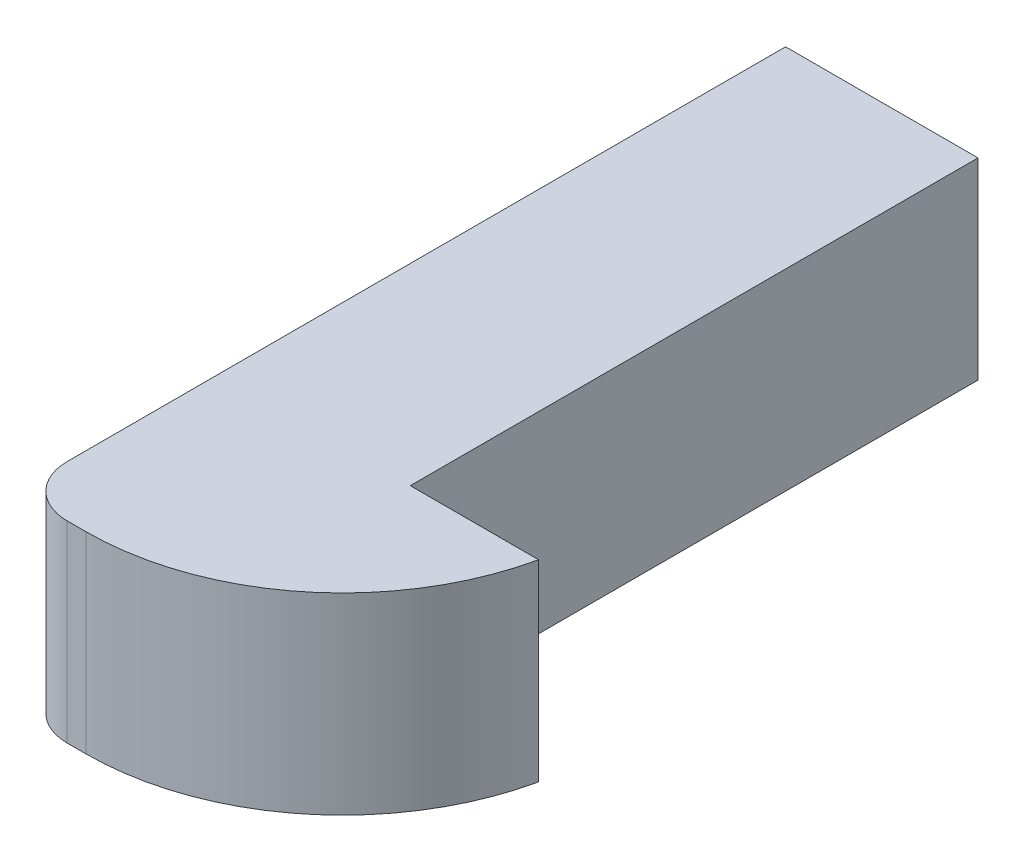
ISO-10303-21;
HEADER;
FILE_DESCRIPTION(('STEP AP214'),'2;1');
FILE_NAME('part.step','',(''),(''),'','','');
FILE_SCHEMA(('AUTOMOTIVE_DESIGN { 1 0 10303 214 1 1 1 1 }'));
ENDSEC;
DATA;
#1=APPLICATION_CONTEXT('core data for automotive mechanical design processes');
#2=APPLICATION_PROTOCOL_DEFINITION('international standard','automotive_design',2000,#1);
#3=PRODUCT_CONTEXT('',#1,'mechanical');
#4=PRODUCT('Part','Part','',(#3));
#5=PRODUCT_RELATED_PRODUCT_CATEGORY('part','',(#4));
#6=PRODUCT_DEFINITION_FORMATION('','',#4);
#7=PRODUCT_DEFINITION_CONTEXT('part definition',#1,'design');
#8=PRODUCT_DEFINITION('design','',#6,#7);
#9=PRODUCT_DEFINITION_SHAPE('','',#8);
#10=(LENGTH_UNIT() NAMED_UNIT(*) SI_UNIT(.MILLI.,.METRE.));
#11=(NAMED_UNIT(*) PLANE_ANGLE_UNIT() SI_UNIT($,.RADIAN.));
#12=(NAMED_UNIT(*) SI_UNIT($,.STERADIAN.) SOLID_ANGLE_UNIT());
#13=UNCERTAINTY_MEASURE_WITH_UNIT(LENGTH_MEASURE(1.E-05),#10,'distance_accuracy_value','');
#14=(GEOMETRIC_REPRESENTATION_CONTEXT(3) GLOBAL_UNCERTAINTY_ASSIGNED_CONTEXT((#13)) GLOBAL_UNIT_ASSIGNED_CONTEXT((#10,
#11,#12)) REPRESENTATION_CONTEXT('',''));
#15=CARTESIAN_POINT('',(0.,0.,0.));
#16=DIRECTION('',(0.,0.,1.));
#17=DIRECTION('',(1.,0.,0.));
#18=AXIS2_PLACEMENT_3D('',#15,#16,#17);
#19=CARTESIAN_POINT('',(0.,0.,38.1));
#20=DIRECTION('',(-1.,0.,0.));
#21=DIRECTION('',(0.,-1.,0.));
#22=AXIS2_PLACEMENT_3D('',#19,#20,#21);
#23=PLANE('',#22);
#24=DIRECTION('',(0.,1.,0.));
#25=VECTOR('',#24,1.);
#26=CARTESIAN_POINT('',(0.,9.525,28.1));
#27=LINE('',#26,#25);
#28=CARTESIAN_POINT('',(0.,0.,28.1));
#29=VERTEX_POINT('',#28);
#30=CARTESIAN_POINT('',(0.,9.525,28.1));
#31=VERTEX_POINT('',#30);
#32=EDGE_CURVE('E92',#29,#31,#27,.T.);
#33=ORIENTED_EDGE('',*,*,#32,.F.);
#34=DIRECTION('',(0.,0.,-1.));
#35=VECTOR('',#34,1.);
#36=CARTESIAN_POINT('',(0.,0.,38.1));
#37=LINE('',#36,#35);
#38=CARTESIAN_POINT('',(0.,0.,0.));
#39=VERTEX_POINT('',#38);
#40=EDGE_CURVE('E147',#29,#39,#37,.T.);
#41=ORIENTED_EDGE('',*,*,#40,.T.);
#42=DIRECTION('',(0.,1.,0.));
#43=VECTOR('',#42,1.);
#44=CARTESIAN_POINT('',(0.,0.,0.));
#45=LINE('',#44,#43);
#46=CARTESIAN_POINT('',(0.,9.525,0.));
#47=VERTEX_POINT('',#46);
#48=EDGE_CURVE('E95',#39,#47,#45,.T.);
#49=ORIENTED_EDGE('',*,*,#48,.T.);
#50=DIRECTION('',(0.,0.,-1.));
#51=VECTOR('',#50,1.);
#52=CARTESIAN_POINT('',(0.,9.525,38.1));
#53=LINE('',#52,#51);
#54=EDGE_CURVE('E90',#31,#47,#53,.T.);
#55=ORIENTED_EDGE('',*,*,#54,.F.);
#56=EDGE_LOOP('',(#33,#41,#49,#55));
#57=FACE_BOUND('',#56,.T.);
#58=ADVANCED_FACE('F32',(#57),#23,.F.);
#59=CARTESIAN_POINT('',(0.,9.525,38.1));
#60=DIRECTION('',(0.,-1.,0.));
#61=DIRECTION('',(1.,0.,0.));
#62=AXIS2_PLACEMENT_3D('',#59,#60,#61);
#63=PLANE('',#62);
#64=DIRECTION('',(0.,0.,-1.));
#65=VECTOR('',#64,1.);
#66=CARTESIAN_POINT('',(-9.525,9.525,38.1));
#67=LINE('',#66,#65);
#68=CARTESIAN_POINT('',(-9.525,9.525,35.56));
#69=VERTEX_POINT('',#68);
#70=CARTESIAN_POINT('',(-9.525,9.525,0.));
#71=VERTEX_POINT('',#70);
#72=EDGE_CURVE('E101',#69,#71,#67,.T.);
#73=ORIENTED_EDGE('',*,*,#72,.F.);
#74=CARTESIAN_POINT('',(-6.985,9.525,35.56));
#75=DIRECTION('',(0.,-1.,0.));
#76=DIRECTION('',(1.,0.,0.));
#77=AXIS2_PLACEMENT_3D('',#74,#75,#76);
#78=CIRCLE('',#77,2.54);
#79=CARTESIAN_POINT('',(-6.985,9.525,38.1));
#80=VERTEX_POINT('',#79);
#81=EDGE_CURVE('E11',#69,#80,#78,.F.);
#82=ORIENTED_EDGE('',*,*,#81,.T.);
#83=DIRECTION('',(-1.,0.,0.));
#84=VECTOR('',#83,1.);
#85=CARTESIAN_POINT('',(0.,9.525,38.1));
#86=LINE('',#85,#84);
#87=CARTESIAN_POINT('',(-6.05967364599086,9.525,38.1));
#88=VERTEX_POINT('',#87);
#89=EDGE_CURVE('E142',#88,#80,#86,.T.);
#90=ORIENTED_EDGE('',*,*,#89,.F.);
#91=CARTESIAN_POINT('',(-6.05967364599086,9.525,25.4));
#92=DIRECTION('',(0.,-1.,0.));
#93=DIRECTION('',(1.,0.,0.));
#94=AXIS2_PLACEMENT_3D('',#91,#92,#93);
#95=CIRCLE('',#94,12.7);
#96=CARTESIAN_POINT('',(6.35,9.525,28.1));
#97=VERTEX_POINT('',#96);
#98=EDGE_CURVE('E117',#88,#97,#95,.F.);
#99=ORIENTED_EDGE('',*,*,#98,.T.);
#100=DIRECTION('',(-1.,0.,0.));
#101=VECTOR('',#100,1.);
#102=CARTESIAN_POINT('',(6.35,9.525,28.1));
#103=LINE('',#102,#101);
#104=EDGE_CURVE('E108',#97,#31,#103,.T.);
#105=ORIENTED_EDGE('',*,*,#104,.T.);
#106=ORIENTED_EDGE('',*,*,#54,.T.);
#107=DIRECTION('',(-1.,0.,0.));
#108=VECTOR('',#107,1.);
#109=CARTESIAN_POINT('',(0.,9.525,0.));
#110=LINE('',#109,#108);
#111=EDGE_CURVE('E166',#47,#71,#110,.T.);
#112=ORIENTED_EDGE('',*,*,#111,.T.);
#113=EDGE_LOOP('',(#73,#82,#90,#99,#105,#106,#112));
#114=FACE_BOUND('',#113,.T.);
#115=ADVANCED_FACE('F114',(#114),#63,.F.);
#116=CARTESIAN_POINT('',(-9.525,0.,38.1));
#117=DIRECTION('',(1.,0.,0.));
#118=DIRECTION('',(0.,0.,-1.));
#119=AXIS2_PLACEMENT_3D('',#116,#117,#118);
#120=PLANE('',#119);
#121=DIRECTION('',(0.,0.,-1.));
#122=VECTOR('',#121,1.);
#123=CARTESIAN_POINT('',(-9.525,0.,38.1));
#124=LINE('',#123,#122);
#125=CARTESIAN_POINT('',(-9.525,0.,35.56));
#126=VERTEX_POINT('',#125);
#127=CARTESIAN_POINT('',(-9.525,0.,0.));
#128=VERTEX_POINT('',#127);
#129=EDGE_CURVE('E149',#126,#128,#124,.T.);
#130=ORIENTED_EDGE('',*,*,#129,.F.);
#131=DIRECTION('',(0.,-1.,0.));
#132=VECTOR('',#131,1.);
#133=CARTESIAN_POINT('',(-9.525,9.525,35.56));
#134=LINE('',#133,#132);
#135=EDGE_CURVE('E39',#126,#69,#134,.F.);
#136=ORIENTED_EDGE('',*,*,#135,.T.);
#137=ORIENTED_EDGE('',*,*,#72,.T.);
#138=DIRECTION('',(0.,-1.,0.));
#139=VECTOR('',#138,1.);
#140=CARTESIAN_POINT('',(-9.525,0.,0.));
#141=LINE('',#140,#139);
#142=EDGE_CURVE('E163',#71,#128,#141,.T.);
#143=ORIENTED_EDGE('',*,*,#142,.T.);
#144=EDGE_LOOP('',(#130,#136,#137,#143));
#145=FACE_BOUND('',#144,.T.);
#146=ADVANCED_FACE('F164',(#145),#120,.F.);
#147=CARTESIAN_POINT('',(0.,0.,38.1));
#148=DIRECTION('',(0.,1.,0.));
#149=DIRECTION('',(-1.,0.,0.));
#150=AXIS2_PLACEMENT_3D('',#147,#148,#149);
#151=PLANE('',#150);
#152=DIRECTION('',(1.,0.,0.));
#153=VECTOR('',#152,1.);
#154=CARTESIAN_POINT('',(0.,0.,38.1));
#155=LINE('',#154,#153);
#156=CARTESIAN_POINT('',(-6.985,0.,38.1));
#157=VERTEX_POINT('',#156);
#158=CARTESIAN_POINT('',(-6.05967364599086,0.,38.1));
#159=VERTEX_POINT('',#158);
#160=EDGE_CURVE('E141',#157,#159,#155,.T.);
#161=ORIENTED_EDGE('',*,*,#160,.F.);
#162=CARTESIAN_POINT('',(-6.985,0.,35.56));
#163=DIRECTION('',(0.,1.,0.));
#164=DIRECTION('',(-1.,0.,0.));
#165=AXIS2_PLACEMENT_3D('',#162,#163,#164);
#166=CIRCLE('',#165,2.54);
#167=EDGE_CURVE('E53',#157,#126,#166,.F.);
#168=ORIENTED_EDGE('',*,*,#167,.T.);
#169=ORIENTED_EDGE('',*,*,#129,.T.);
#170=DIRECTION('',(1.,0.,0.));
#171=VECTOR('',#170,1.);
#172=CARTESIAN_POINT('',(0.,0.,0.));
#173=LINE('',#172,#171);
#174=EDGE_CURVE('E150',#128,#39,#173,.T.);
#175=ORIENTED_EDGE('',*,*,#174,.T.);
#176=ORIENTED_EDGE('',*,*,#40,.F.);
#177=DIRECTION('',(-1.,0.,0.));
#178=VECTOR('',#177,1.);
#179=CARTESIAN_POINT('',(6.35,0.,28.1));
#180=LINE('',#179,#178);
#181=CARTESIAN_POINT('',(6.35,0.,28.1));
#182=VERTEX_POINT('',#181);
#183=EDGE_CURVE('E111',#182,#29,#180,.T.);
#184=ORIENTED_EDGE('',*,*,#183,.F.);
#185=CARTESIAN_POINT('',(-6.05967364599086,0.,25.4));
#186=DIRECTION('',(0.,1.,0.));
#187=DIRECTION('',(-1.,0.,0.));
#188=AXIS2_PLACEMENT_3D('',#185,#186,#187);
#189=CIRCLE('',#188,12.7);
#190=EDGE_CURVE('E100',#182,#159,#189,.F.);
#191=ORIENTED_EDGE('',*,*,#190,.T.);
#192=EDGE_LOOP('',(#161,#168,#169,#175,#176,#184,#191));
#193=FACE_BOUND('',#192,.T.);
#194=ADVANCED_FACE('F145',(#193),#151,.F.);
#195=CARTESIAN_POINT('',(0.,0.,38.1));
#196=DIRECTION('',(0.,0.,1.));
#197=DIRECTION('',(1.,0.,0.));
#198=AXIS2_PLACEMENT_3D('',#195,#196,#197);
#199=PLANE('',#198);
#200=ORIENTED_EDGE('',*,*,#89,.T.);
#201=DIRECTION('',(0.,-1.,0.));
#202=VECTOR('',#201,1.);
#203=CARTESIAN_POINT('',(-6.985,0.,38.1));
#204=LINE('',#203,#202);
#205=EDGE_CURVE('E134',#80,#157,#204,.T.);
#206=ORIENTED_EDGE('',*,*,#205,.T.);
#207=ORIENTED_EDGE('',*,*,#160,.T.);
#208=DIRECTION('',(0.,1.,0.));
#209=VECTOR('',#208,1.);
#210=CARTESIAN_POINT('',(-6.05967364599086,9.525,38.1));
#211=LINE('',#210,#209);
#212=EDGE_CURVE('E131',#159,#88,#211,.T.);
#213=ORIENTED_EDGE('',*,*,#212,.T.);
#214=EDGE_LOOP('',(#200,#206,#207,#213));
#215=FACE_BOUND('',#214,.T.);
#216=ADVANCED_FACE('F140',(#215),#199,.T.);
#217=CARTESIAN_POINT('',(0.,0.,0.));
#218=DIRECTION('',(0.,0.,1.));
#219=DIRECTION('',(1.,0.,0.));
#220=AXIS2_PLACEMENT_3D('',#217,#218,#219);
#221=PLANE('',#220);
#222=CARTESIAN_POINT('',(-4.7625,4.7625,0.));
#223=DIRECTION('',(0.,0.,-1.));
#224=DIRECTION('',(-1.,0.,0.));
#225=AXIS2_PLACEMENT_3D('',#222,#223,#224);
#226=CIRCLE('',#225,3.175);
#227=CARTESIAN_POINT('',(-7.9375,4.7625,0.));
#228=VERTEX_POINT('',#227);
#229=EDGE_CURVE('E172',#228,#228,#226,.T.);
#230=ORIENTED_EDGE('',*,*,#229,.F.);
#231=EDGE_LOOP('',(#230));
#232=FACE_BOUND('',#231,.T.);
#233=ORIENTED_EDGE('',*,*,#48,.F.);
#234=ORIENTED_EDGE('',*,*,#174,.F.);
#235=ORIENTED_EDGE('',*,*,#142,.F.);
#236=ORIENTED_EDGE('',*,*,#111,.F.);
#237=EDGE_LOOP('',(#233,#234,#235,#236));
#238=FACE_BOUND('',#237,.T.);
#239=ADVANCED_FACE('F168',(#232,#238),#221,.F.);
#240=CARTESIAN_POINT('',(-4.7625,4.7625,0.));
#241=DIRECTION('',(0.,0.,-1.));
#242=DIRECTION('',(-1.,0.,0.));
#243=AXIS2_PLACEMENT_3D('',#240,#241,#242);
#244=CYLINDRICAL_SURFACE('',#243,3.175);
#245=CARTESIAN_POINT('',(-4.7625,4.7625,14.986));
#246=DIRECTION('',(0.,0.,-1.));
#247=DIRECTION('',(-1.,0.,0.));
#248=AXIS2_PLACEMENT_3D('',#245,#246,#247);
#249=CIRCLE('',#248,3.175);
#250=CARTESIAN_POINT('',(-7.9375,4.7625,14.986));
#251=VERTEX_POINT('',#250);
#252=EDGE_CURVE('E175',#251,#251,#249,.T.);
#253=ORIENTED_EDGE('',*,*,#252,.F.);
#254=EDGE_LOOP('',(#253));
#255=FACE_BOUND('',#254,.T.);
#256=ORIENTED_EDGE('',*,*,#229,.T.);
#257=EDGE_LOOP('',(#256));
#258=FACE_BOUND('',#257,.T.);
#259=ADVANCED_FACE('F196',(#255,#258),#244,.F.);
#260=CARTESIAN_POINT('',(-2.2098,4.7625,14.986));
#261=DIRECTION('',(0.,0.,1.));
#262=DIRECTION('',(1.,0.,0.));
#263=AXIS2_PLACEMENT_3D('',#260,#261,#262);
#264=PLANE('',#263);
#265=CARTESIAN_POINT('',(-4.7625,4.7625,14.986));
#266=DIRECTION('',(0.,0.,-1.));
#267=DIRECTION('',(-1.,0.,0.));
#268=AXIS2_PLACEMENT_3D('',#265,#266,#267);
#269=CIRCLE('',#268,2.5527);
#270=CARTESIAN_POINT('',(-7.3152,4.7625,14.986));
#271=VERTEX_POINT('',#270);
#272=EDGE_CURVE('E178',#271,#271,#269,.T.);
#273=ORIENTED_EDGE('',*,*,#272,.F.);
#274=EDGE_LOOP('',(#273));
#275=FACE_BOUND('',#274,.T.);
#276=ORIENTED_EDGE('',*,*,#252,.T.);
#277=EDGE_LOOP('',(#276));
#278=FACE_BOUND('',#277,.T.);
#279=ADVANCED_FACE('F190',(#275,#278),#264,.F.);
#280=CARTESIAN_POINT('',(-4.7625,4.7625,0.));
#281=DIRECTION('',(0.,0.,-1.));
#282=DIRECTION('',(-1.,0.,0.));
#283=AXIS2_PLACEMENT_3D('',#280,#281,#282);
#284=CYLINDRICAL_SURFACE('',#283,2.5527);
#285=CARTESIAN_POINT('',(-4.7625,4.7625,21.336));
#286=DIRECTION('',(0.,0.,-1.));
#287=DIRECTION('',(-1.,0.,0.));
#288=AXIS2_PLACEMENT_3D('',#285,#286,#287);
#289=CIRCLE('',#288,2.55269999999999);
#290=CARTESIAN_POINT('',(-7.3152,4.7625,21.336));
#291=VERTEX_POINT('',#290);
#292=EDGE_CURVE('E119',#291,#291,#289,.T.);
#293=ORIENTED_EDGE('',*,*,#292,.F.);
#294=EDGE_LOOP('',(#293));
#295=FACE_BOUND('',#294,.T.);
#296=ORIENTED_EDGE('',*,*,#272,.T.);
#297=EDGE_LOOP('',(#296));
#298=FACE_BOUND('',#297,.T.);
#299=ADVANCED_FACE('F187',(#295,#298),#284,.F.);
#300=CARTESIAN_POINT('',(-4.7625,4.7625,21.336));
#301=DIRECTION('',(0.,0.,-1.));
#302=DIRECTION('',(-1.,0.,0.));
#303=AXIS2_PLACEMENT_3D('',#300,#301,#302);
#304=CONICAL_SURFACE('',#303,2.55269999999999,1.02974425867665);
#305=CARTESIAN_POINT('',(-4.76250000000001,4.7625,22.8698169021917));
#306=VERTEX_POINT('',#305);
#307=VERTEX_LOOP('',#306);
#308=FACE_BOUND('',#307,.T.);
#309=ORIENTED_EDGE('',*,*,#292,.T.);
#310=EDGE_LOOP('',(#309));
#311=FACE_BOUND('',#310,.T.);
#312=ADVANCED_FACE('F185',(#308,#311),#304,.F.);
#313=CARTESIAN_POINT('',(6.35,9.525,28.1));
#314=DIRECTION('',(0.,0.,1.));
#315=DIRECTION('',(1.,0.,0.));
#316=AXIS2_PLACEMENT_3D('',#313,#314,#315);
#317=PLANE('',#316);
#318=ORIENTED_EDGE('',*,*,#32,.T.);
#319=ORIENTED_EDGE('',*,*,#104,.F.);
#320=DIRECTION('',(0.,1.,0.));
#321=VECTOR('',#320,1.);
#322=CARTESIAN_POINT('',(6.35,9.525,28.1));
#323=LINE('',#322,#321);
#324=EDGE_CURVE('E112',#182,#97,#323,.T.);
#325=ORIENTED_EDGE('',*,*,#324,.F.);
#326=ORIENTED_EDGE('',*,*,#183,.T.);
#327=EDGE_LOOP('',(#318,#319,#325,#326));
#328=FACE_BOUND('',#327,.T.);
#329=ADVANCED_FACE('F106',(#328),#317,.F.);
#330=CARTESIAN_POINT('',(-6.05967364599086,0.,25.4));
#331=DIRECTION('',(0.,-1.,0.));
#332=DIRECTION('',(1.,0.,0.));
#333=AXIS2_PLACEMENT_3D('',#330,#331,#332);
#334=CYLINDRICAL_SURFACE('',#333,12.7);
#335=ORIENTED_EDGE('',*,*,#98,.F.);
#336=ORIENTED_EDGE('',*,*,#212,.F.);
#337=ORIENTED_EDGE('',*,*,#190,.F.);
#338=ORIENTED_EDGE('',*,*,#324,.T.);
#339=EDGE_LOOP('',(#335,#336,#337,#338));
#340=FACE_BOUND('',#339,.T.);
#341=ADVANCED_FACE('F240',(#340),#334,.T.);
#342=CARTESIAN_POINT('',(-6.985,0.,35.56));
#343=DIRECTION('',(0.,1.,0.));
#344=DIRECTION('',(0.,0.,1.));
#345=AXIS2_PLACEMENT_3D('',#342,#343,#344);
#346=CYLINDRICAL_SURFACE('',#345,2.54);
#347=ORIENTED_EDGE('',*,*,#81,.F.);
#348=ORIENTED_EDGE('',*,*,#135,.F.);
#349=ORIENTED_EDGE('',*,*,#167,.F.);
#350=ORIENTED_EDGE('',*,*,#205,.F.);
#351=EDGE_LOOP('',(#347,#348,#349,#350));
#352=FACE_BOUND('',#351,.T.);
#353=ADVANCED_FACE('F236',(#352),#346,.T.);
#354=CLOSED_SHELL('',(#58,#115,#146,#194,#216,#239,#259,#279,#299,#312,#329,#341,#353));
#355=MANIFOLD_SOLID_BREP('B2',#354);
#356=ADVANCED_BREP_SHAPE_REPRESENTATION('',(#18,#355),#14);
#357=SHAPE_DEFINITION_REPRESENTATION(#9,#356);
ENDSEC;
END-ISO-10303-21;
